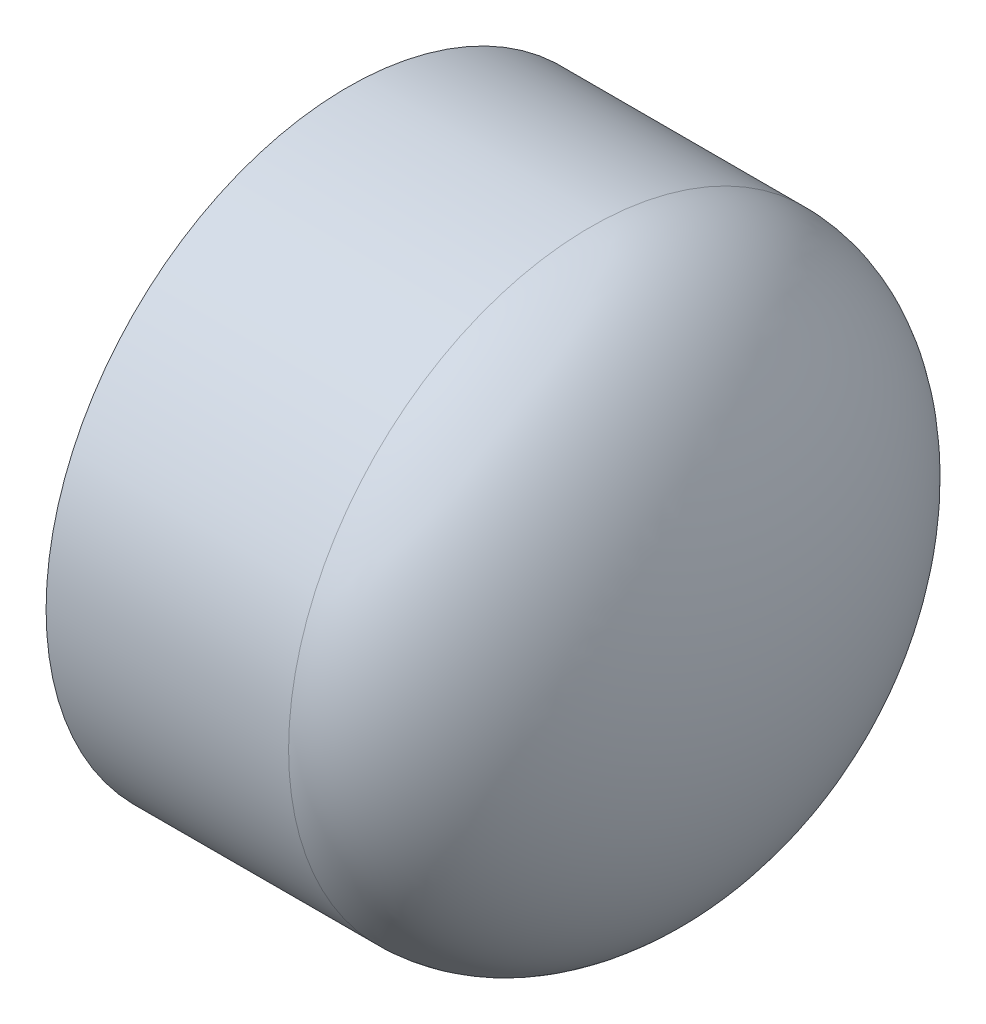
ISO-10303-21;
HEADER;
FILE_DESCRIPTION(('STEP AP214'),'2;1');
FILE_NAME('part.step','',(''),(''),'','','');
FILE_SCHEMA(('AUTOMOTIVE_DESIGN { 1 0 10303 214 1 1 1 1 }'));
ENDSEC;
DATA;
#1=APPLICATION_CONTEXT('core data for automotive mechanical design processes');
#2=APPLICATION_PROTOCOL_DEFINITION('international standard','automotive_design',2000,#1);
#3=PRODUCT_CONTEXT('',#1,'mechanical');
#4=PRODUCT('Part','Part','',(#3));
#5=PRODUCT_RELATED_PRODUCT_CATEGORY('part','',(#4));
#6=PRODUCT_DEFINITION_FORMATION('','',#4);
#7=PRODUCT_DEFINITION_CONTEXT('part definition',#1,'design');
#8=PRODUCT_DEFINITION('design','',#6,#7);
#9=PRODUCT_DEFINITION_SHAPE('','',#8);
#10=(LENGTH_UNIT() NAMED_UNIT(*) SI_UNIT(.MILLI.,.METRE.));
#11=(NAMED_UNIT(*) PLANE_ANGLE_UNIT() SI_UNIT($,.RADIAN.));
#12=(NAMED_UNIT(*) SI_UNIT($,.STERADIAN.) SOLID_ANGLE_UNIT());
#13=UNCERTAINTY_MEASURE_WITH_UNIT(LENGTH_MEASURE(1.E-05),#10,'distance_accuracy_value','');
#14=(GEOMETRIC_REPRESENTATION_CONTEXT(3) GLOBAL_UNCERTAINTY_ASSIGNED_CONTEXT((#13)) GLOBAL_UNIT_ASSIGNED_CONTEXT((#10,
#11,#12)) REPRESENTATION_CONTEXT('',''));
#15=CARTESIAN_POINT('',(0.,0.,0.));
#16=DIRECTION('',(0.,0.,1.));
#17=DIRECTION('',(1.,0.,0.));
#18=AXIS2_PLACEMENT_3D('',#15,#16,#17);
#19=CARTESIAN_POINT('',(-44.3992,0.,0.));
#20=DIRECTION('',(-1.,0.,0.));
#21=DIRECTION('',(0.,0.,1.));
#22=AXIS2_PLACEMENT_3D('',#19,#20,#21);
#23=CYLINDRICAL_SURFACE('',#22,63.8175);
#24=CARTESIAN_POINT('',(6.9088,0.,0.));
#25=DIRECTION('',(-1.,0.,0.));
#26=DIRECTION('',(0.,0.,1.));
#27=AXIS2_PLACEMENT_3D('',#24,#25,#26);
#28=CIRCLE('',#27,63.8175);
#29=CARTESIAN_POINT('',(6.9088,0.,63.8175));
#30=VERTEX_POINT('',#29);
#31=EDGE_CURVE('E11',#30,#30,#28,.T.);
#32=ORIENTED_EDGE('',*,*,#31,.T.);
#33=EDGE_LOOP('',(#32));
#34=FACE_BOUND('',#33,.T.);
#35=CARTESIAN_POINT('',(-44.3992,0.,0.));
#36=DIRECTION('',(-1.,0.,0.));
#37=DIRECTION('',(0.,0.,1.));
#38=AXIS2_PLACEMENT_3D('',#35,#36,#37);
#39=CIRCLE('',#38,63.8175);
#40=CARTESIAN_POINT('',(-44.3992,0.,63.8175));
#41=VERTEX_POINT('',#40);
#42=EDGE_CURVE('E55',#41,#41,#39,.T.);
#43=ORIENTED_EDGE('',*,*,#42,.F.);
#44=EDGE_LOOP('',(#43));
#45=FACE_BOUND('',#44,.T.);
#46=ADVANCED_FACE('F32',(#34,#45),#23,.T.);
#47=CARTESIAN_POINT('',(6.90880000000001,0.,0.));
#48=DIRECTION('',(0.,0.,1.));
#49=DIRECTION('',(0.,1.,0.));
#50=AXIS2_PLACEMENT_3D('',#47,#48,#49);
#51=ELLIPSE('',#50,63.8175,37.4904);
#52=TRIMMED_CURVE('',#51,(PARAMETER_VALUE(1.5707963267949)),(PARAMETER_VALUE(4.71238898038469)),
.T.,.PARAMETER.);
#53=CARTESIAN_POINT('',(-44.3992,0.,0.));
#54=DIRECTION('',(-1.,0.,0.));
#55=AXIS1_PLACEMENT('',#53,#54);
#56=SURFACE_OF_REVOLUTION('',#52,#55);
#57=CARTESIAN_POINT('',(44.3992,0.,0.));
#58=VERTEX_POINT('',#57);
#59=VERTEX_LOOP('',#58);
#60=FACE_BOUND('',#59,.T.);
#61=ORIENTED_EDGE('',*,*,#31,.F.);
#62=EDGE_LOOP('',(#61));
#63=FACE_BOUND('',#62,.T.);
#64=ADVANCED_FACE('F45',(#60,#63),#56,.F.);
#65=CARTESIAN_POINT('',(6.90880000000001,0.,0.));
#66=DIRECTION('',(0.,0.,-1.));
#67=DIRECTION('',(0.,-1.,0.));
#68=AXIS2_PLACEMENT_3D('',#65,#66,#67);
#69=ELLIPSE('',#68,57.0357,30.7086);
#70=TRIMMED_CURVE('',#69,(PARAMETER_VALUE(4.71238898038469)),
(PARAMETER_VALUE(7.85398163397448)),.T.,.PARAMETER.);
#71=CARTESIAN_POINT('',(-44.3992,0.,0.));
#72=DIRECTION('',(-1.,0.,0.));
#73=AXIS1_PLACEMENT('',#71,#72);
#74=SURFACE_OF_REVOLUTION('',#70,#73);
#75=CARTESIAN_POINT('',(6.90880000000001,0.,0.));
#76=DIRECTION('',(-1.,0.,0.));
#77=DIRECTION('',(0.,0.,1.));
#78=AXIS2_PLACEMENT_3D('',#75,#76,#77);
#79=CIRCLE('',#78,57.0357);
#80=CARTESIAN_POINT('',(6.90880000000001,0.,57.0357));
#81=VERTEX_POINT('',#80);
#82=EDGE_CURVE('E39',#81,#81,#79,.T.);
#83=ORIENTED_EDGE('',*,*,#82,.T.);
#84=EDGE_LOOP('',(#83));
#85=FACE_BOUND('',#84,.T.);
#86=CARTESIAN_POINT('',(37.6174,0.,0.));
#87=VERTEX_POINT('',#86);
#88=VERTEX_LOOP('',#87);
#89=FACE_BOUND('',#88,.T.);
#90=ADVANCED_FACE('F48',(#85,#89),#74,.F.);
#91=CARTESIAN_POINT('',(6.90880000000001,0.,0.));
#92=DIRECTION('',(-1.,0.,0.));
#93=DIRECTION('',(0.,0.,1.));
#94=AXIS2_PLACEMENT_3D('',#91,#92,#93);
#95=CONICAL_SURFACE('',#94,57.0357,0.00668306881884247);
#96=CARTESIAN_POINT('',(-44.3992,0.,0.));
#97=DIRECTION('',(-1.,0.,0.));
#98=DIRECTION('',(0.,0.,1.));
#99=AXIS2_PLACEMENT_3D('',#96,#97,#98);
#100=CIRCLE('',#99,57.3786);
#101=CARTESIAN_POINT('',(-44.3992,0.,57.3786));
#102=VERTEX_POINT('',#101);
#103=EDGE_CURVE('E57',#102,#102,#100,.T.);
#104=ORIENTED_EDGE('',*,*,#103,.T.);
#105=EDGE_LOOP('',(#104));
#106=FACE_BOUND('',#105,.T.);
#107=ORIENTED_EDGE('',*,*,#82,.F.);
#108=EDGE_LOOP('',(#107));
#109=FACE_BOUND('',#108,.T.);
#110=ADVANCED_FACE('F68',(#106,#109),#95,.F.);
#111=CARTESIAN_POINT('',(-44.3992,-63.8175,0.));
#112=DIRECTION('',(-1.,0.,0.));
#113=DIRECTION('',(0.,0.,1.));
#114=AXIS2_PLACEMENT_3D('',#111,#112,#113);
#115=PLANE('',#114);
#116=ORIENTED_EDGE('',*,*,#42,.T.);
#117=EDGE_LOOP('',(#116));
#118=FACE_BOUND('',#117,.T.);
#119=ORIENTED_EDGE('',*,*,#103,.F.);
#120=EDGE_LOOP('',(#119));
#121=FACE_BOUND('',#120,.T.);
#122=ADVANCED_FACE('F70',(#118,#121),#115,.T.);
#123=CLOSED_SHELL('',(#46,#64,#90,#110,#122));
#124=MANIFOLD_SOLID_BREP('B2',#123);
#125=ADVANCED_BREP_SHAPE_REPRESENTATION('',(#18,#124),#14);
#126=SHAPE_DEFINITION_REPRESENTATION(#9,#125);
ENDSEC;
END-ISO-10303-21;
